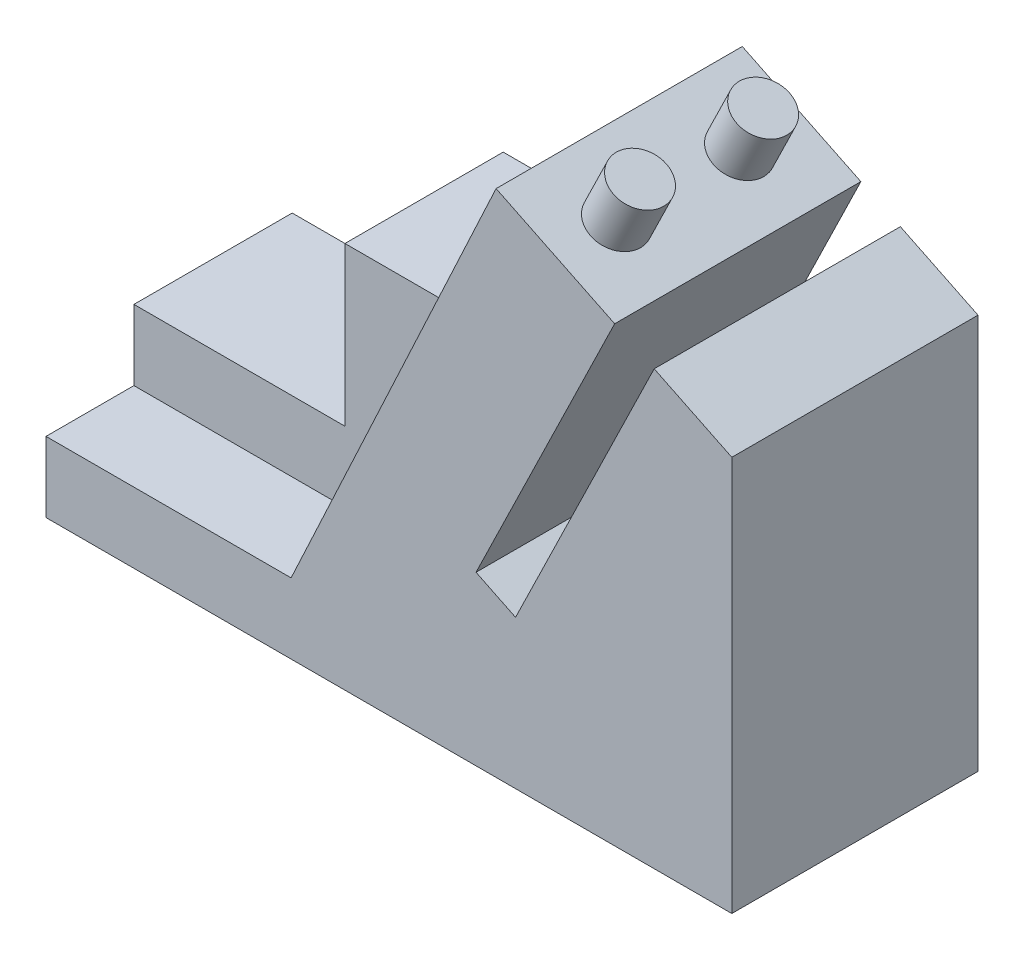
ISO-10303-21;
HEADER;
FILE_DESCRIPTION(('STEP AP214'),'2;1');
FILE_NAME('part.step','',(''),(''),'','','');
FILE_SCHEMA(('AUTOMOTIVE_DESIGN { 1 0 10303 214 1 1 1 1 }'));
ENDSEC;
DATA;
#1=APPLICATION_CONTEXT('core data for automotive mechanical design processes');
#2=APPLICATION_PROTOCOL_DEFINITION('international standard','automotive_design',2000,#1);
#3=PRODUCT_CONTEXT('',#1,'mechanical');
#4=PRODUCT('Part','Part','',(#3));
#5=PRODUCT_RELATED_PRODUCT_CATEGORY('part','',(#4));
#6=PRODUCT_DEFINITION_FORMATION('','',#4);
#7=PRODUCT_DEFINITION_CONTEXT('part definition',#1,'design');
#8=PRODUCT_DEFINITION('design','',#6,#7);
#9=PRODUCT_DEFINITION_SHAPE('','',#8);
#10=(LENGTH_UNIT() NAMED_UNIT(*) SI_UNIT(.MILLI.,.METRE.));
#11=(NAMED_UNIT(*) PLANE_ANGLE_UNIT() SI_UNIT($,.RADIAN.));
#12=(NAMED_UNIT(*) SI_UNIT($,.STERADIAN.) SOLID_ANGLE_UNIT());
#13=UNCERTAINTY_MEASURE_WITH_UNIT(LENGTH_MEASURE(1.E-05),#10,'distance_accuracy_value','');
#14=(GEOMETRIC_REPRESENTATION_CONTEXT(3) GLOBAL_UNCERTAINTY_ASSIGNED_CONTEXT((#13)) GLOBAL_UNIT_ASSIGNED_CONTEXT((#10,
#11,#12)) REPRESENTATION_CONTEXT('',''));
#15=CARTESIAN_POINT('',(0.,0.,0.));
#16=DIRECTION('',(0.,0.,1.));
#17=DIRECTION('',(1.,0.,0.));
#18=AXIS2_PLACEMENT_3D('',#15,#16,#17);
#19=CARTESIAN_POINT('',(0.,8.,28.));
#20=DIRECTION('',(0.,-1.,0.));
#21=DIRECTION('',(0.,0.,-1.));
#22=AXIS2_PLACEMENT_3D('',#19,#20,#21);
#23=PLANE('',#22);
#24=DIRECTION('',(-1.,0.,0.));
#25=VECTOR('',#24,1.);
#26=CARTESIAN_POINT('',(27.8760008879701,8.,18.));
#27=LINE('',#26,#25);
#28=CARTESIAN_POINT('',(27.8760008879701,8.,18.));
#29=VERTEX_POINT('',#28);
#30=CARTESIAN_POINT('',(0.,8.,18.));
#31=VERTEX_POINT('',#30);
#32=EDGE_CURVE('E174',#29,#31,#27,.T.);
#33=ORIENTED_EDGE('',*,*,#32,.T.);
#34=DIRECTION('',(0.,0.,-1.));
#35=VECTOR('',#34,1.);
#36=CARTESIAN_POINT('',(0.,8.,28.));
#37=LINE('',#36,#35);
#38=CARTESIAN_POINT('',(0.,8.,28.));
#39=VERTEX_POINT('',#38);
#40=EDGE_CURVE('E172',#39,#31,#37,.T.);
#41=ORIENTED_EDGE('',*,*,#40,.F.);
#42=DIRECTION('',(-1.,0.,0.));
#43=VECTOR('',#42,1.);
#44=CARTESIAN_POINT('',(0.,8.,28.));
#45=LINE('',#44,#43);
#46=CARTESIAN_POINT('',(27.8760008879701,8.,28.));
#47=VERTEX_POINT('',#46);
#48=EDGE_CURVE('E235',#47,#39,#45,.T.);
#49=ORIENTED_EDGE('',*,*,#48,.F.);
#50=DIRECTION('',(0.,0.,-1.));
#51=VECTOR('',#50,1.);
#52=CARTESIAN_POINT('',(27.8760008879701,8.,28.));
#53=LINE('',#52,#51);
#54=EDGE_CURVE('E265',#47,#29,#53,.T.);
#55=ORIENTED_EDGE('',*,*,#54,.T.);
#56=EDGE_LOOP('',(#33,#41,#49,#55));
#57=FACE_BOUND('',#56,.T.);
#58=ADVANCED_FACE('F43',(#57),#23,.F.);
#59=CARTESIAN_POINT('',(0.,0.,28.));
#60=DIRECTION('',(1.,0.,0.));
#61=DIRECTION('',(0.,0.,-1.));
#62=AXIS2_PLACEMENT_3D('',#59,#60,#61);
#63=PLANE('',#62);
#64=DIRECTION('',(0.,-1.,0.));
#65=VECTOR('',#64,1.);
#66=CARTESIAN_POINT('',(0.,0.,0.));
#67=LINE('',#66,#65);
#68=CARTESIAN_POINT('',(0.,16.,0.));
#69=VERTEX_POINT('',#68);
#70=CARTESIAN_POINT('',(0.,0.,0.));
#71=VERTEX_POINT('',#70);
#72=EDGE_CURVE('E200',#69,#71,#67,.T.);
#73=ORIENTED_EDGE('',*,*,#72,.T.);
#74=DIRECTION('',(0.,0.,-1.));
#75=VECTOR('',#74,1.);
#76=CARTESIAN_POINT('',(0.,0.,28.));
#77=LINE('',#76,#75);
#78=CARTESIAN_POINT('',(0.,0.,28.));
#79=VERTEX_POINT('',#78);
#80=EDGE_CURVE('E296',#79,#71,#77,.T.);
#81=ORIENTED_EDGE('',*,*,#80,.F.);
#82=DIRECTION('',(0.,-1.,0.));
#83=VECTOR('',#82,1.);
#84=CARTESIAN_POINT('',(0.,0.,28.));
#85=LINE('',#84,#83);
#86=EDGE_CURVE('E206',#39,#79,#85,.T.);
#87=ORIENTED_EDGE('',*,*,#86,.F.);
#88=ORIENTED_EDGE('',*,*,#40,.T.);
#89=DIRECTION('',(0.,1.,0.));
#90=VECTOR('',#89,1.);
#91=CARTESIAN_POINT('',(0.,8.,18.));
#92=LINE('',#91,#90);
#93=CARTESIAN_POINT('',(0.,16.,18.));
#94=VERTEX_POINT('',#93);
#95=EDGE_CURVE('E163',#31,#94,#92,.T.);
#96=ORIENTED_EDGE('',*,*,#95,.T.);
#97=DIRECTION('',(0.,0.,-1.));
#98=VECTOR('',#97,1.);
#99=CARTESIAN_POINT('',(0.,16.,18.));
#100=LINE('',#99,#98);
#101=EDGE_CURVE('E146',#94,#69,#100,.T.);
#102=ORIENTED_EDGE('',*,*,#101,.T.);
#103=EDGE_LOOP('',(#73,#81,#87,#88,#96,#102));
#104=FACE_BOUND('',#103,.T.);
#105=ADVANCED_FACE('F45',(#104),#63,.F.);
#106=CARTESIAN_POINT('',(0.,0.,28.));
#107=DIRECTION('',(0.,1.,0.));
#108=DIRECTION('',(0.,0.,1.));
#109=AXIS2_PLACEMENT_3D('',#106,#107,#108);
#110=PLANE('',#109);
#111=DIRECTION('',(1.,0.,0.));
#112=VECTOR('',#111,1.);
#113=CARTESIAN_POINT('',(0.,0.,0.));
#114=LINE('',#113,#112);
#115=CARTESIAN_POINT('',(78.,0.,0.));
#116=VERTEX_POINT('',#115);
#117=EDGE_CURVE('E240',#71,#116,#114,.T.);
#118=ORIENTED_EDGE('',*,*,#117,.T.);
#119=DIRECTION('',(0.,0.,-1.));
#120=VECTOR('',#119,1.);
#121=CARTESIAN_POINT('',(78.,0.,28.));
#122=LINE('',#121,#120);
#123=CARTESIAN_POINT('',(78.,0.,28.));
#124=VERTEX_POINT('',#123);
#125=EDGE_CURVE('E292',#124,#116,#122,.T.);
#126=ORIENTED_EDGE('',*,*,#125,.F.);
#127=DIRECTION('',(1.,0.,0.));
#128=VECTOR('',#127,1.);
#129=CARTESIAN_POINT('',(0.,0.,28.));
#130=LINE('',#129,#128);
#131=EDGE_CURVE('E210',#79,#124,#130,.T.);
#132=ORIENTED_EDGE('',*,*,#131,.F.);
#133=ORIENTED_EDGE('',*,*,#80,.T.);
#134=EDGE_LOOP('',(#118,#126,#132,#133));
#135=FACE_BOUND('',#134,.T.);
#136=ADVANCED_FACE('F354',(#135),#110,.F.);
#137=CARTESIAN_POINT('',(78.,0.,28.));
#138=DIRECTION('',(-1.,0.,0.));
#139=DIRECTION('',(0.,0.,1.));
#140=AXIS2_PLACEMENT_3D('',#137,#138,#139);
#141=PLANE('',#140);
#142=DIRECTION('',(0.,1.,0.));
#143=VECTOR('',#142,1.);
#144=CARTESIAN_POINT('',(78.,0.,0.));
#145=LINE('',#144,#143);
#146=CARTESIAN_POINT('',(78.,44.9393921056072,0.));
#147=VERTEX_POINT('',#146);
#148=EDGE_CURVE('E243',#116,#147,#145,.T.);
#149=ORIENTED_EDGE('',*,*,#148,.T.);
#150=DIRECTION('',(0.,0.,-1.));
#151=VECTOR('',#150,1.);
#152=CARTESIAN_POINT('',(78.,44.9393921056072,28.));
#153=LINE('',#152,#151);
#154=CARTESIAN_POINT('',(78.,44.9393921056072,28.));
#155=VERTEX_POINT('',#154);
#156=EDGE_CURVE('E288',#155,#147,#153,.T.);
#157=ORIENTED_EDGE('',*,*,#156,.F.);
#158=DIRECTION('',(0.,1.,0.));
#159=VECTOR('',#158,1.);
#160=CARTESIAN_POINT('',(78.,0.,28.));
#161=LINE('',#160,#159);
#162=EDGE_CURVE('E214',#124,#155,#161,.T.);
#163=ORIENTED_EDGE('',*,*,#162,.F.);
#164=ORIENTED_EDGE('',*,*,#125,.T.);
#165=EDGE_LOOP('',(#149,#157,#163,#164));
#166=FACE_BOUND('',#165,.T.);
#167=ADVANCED_FACE('F350',(#166),#141,.F.);
#168=CARTESIAN_POINT('',(69.1711811724653,49.2406115344061,28.));
#169=DIRECTION('',(-0.437969423279694,-0.89898986883727,0.));
#170=DIRECTION('',(0.89898986883727,-0.437969423279694,0.));
#171=AXIS2_PLACEMENT_3D('',#168,#169,#170);
#172=PLANE('',#171);
#173=DIRECTION('',(-0.89898986883727,0.437969423279694,0.));
#174=VECTOR('',#173,1.);
#175=CARTESIAN_POINT('',(69.1711811724653,49.2406115344061,0.));
#176=LINE('',#175,#174);
#177=CARTESIAN_POINT('',(69.1711811724653,49.2406115344061,0.));
#178=VERTEX_POINT('',#177);
#179=EDGE_CURVE('E246',#147,#178,#176,.T.);
#180=ORIENTED_EDGE('',*,*,#179,.T.);
#181=DIRECTION('',(0.,0.,-1.));
#182=VECTOR('',#181,1.);
#183=CARTESIAN_POINT('',(69.1711811724653,49.2406115344061,28.));
#184=LINE('',#183,#182);
#185=CARTESIAN_POINT('',(69.1711811724653,49.2406115344061,28.));
#186=VERTEX_POINT('',#185);
#187=EDGE_CURVE('E284',#186,#178,#184,.T.);
#188=ORIENTED_EDGE('',*,*,#187,.F.);
#189=DIRECTION('',(-0.89898986883727,0.437969423279694,0.));
#190=VECTOR('',#189,1.);
#191=CARTESIAN_POINT('',(69.1711811724653,49.2406115344061,28.));
#192=LINE('',#191,#190);
#193=EDGE_CURVE('E217',#155,#186,#192,.T.);
#194=ORIENTED_EDGE('',*,*,#193,.F.);
#195=ORIENTED_EDGE('',*,*,#156,.T.);
#196=EDGE_LOOP('',(#180,#188,#194,#195));
#197=FACE_BOUND('',#196,.T.);
#198=ADVANCED_FACE('F346',(#197),#172,.F.);
#199=CARTESIAN_POINT('',(53.4042819343963,16.8769762562644,28.));
#200=DIRECTION('',(0.89898986883727,-0.437969423279694,0.));
#201=DIRECTION('',(0.437969423279694,0.89898986883727,0.));
#202=AXIS2_PLACEMENT_3D('',#199,#200,#201);
#203=PLANE('',#202);
#204=DIRECTION('',(-0.437969423279694,-0.89898986883727,0.));
#205=VECTOR('',#204,1.);
#206=CARTESIAN_POINT('',(53.4042819343963,16.8769762562644,0.));
#207=LINE('',#206,#205);
#208=CARTESIAN_POINT('',(53.4042819343963,16.8769762562644,0.));
#209=VERTEX_POINT('',#208);
#210=EDGE_CURVE('E249',#178,#209,#207,.T.);
#211=ORIENTED_EDGE('',*,*,#210,.T.);
#212=DIRECTION('',(0.,0.,-1.));
#213=VECTOR('',#212,1.);
#214=CARTESIAN_POINT('',(53.4042819343963,16.8769762562644,28.));
#215=LINE('',#214,#213);
#216=CARTESIAN_POINT('',(53.4042819343963,16.8769762562644,28.));
#217=VERTEX_POINT('',#216);
#218=EDGE_CURVE('E280',#217,#209,#215,.T.);
#219=ORIENTED_EDGE('',*,*,#218,.F.);
#220=DIRECTION('',(-0.437969423279694,-0.89898986883727,0.));
#221=VECTOR('',#220,1.);
#222=CARTESIAN_POINT('',(53.4042819343963,16.8769762562644,28.));
#223=LINE('',#222,#221);
#224=EDGE_CURVE('E220',#186,#217,#223,.T.);
#225=ORIENTED_EDGE('',*,*,#224,.F.);
#226=ORIENTED_EDGE('',*,*,#187,.T.);
#227=EDGE_LOOP('',(#211,#219,#225,#226));
#228=FACE_BOUND('',#227,.T.);
#229=ADVANCED_FACE('F342',(#228),#203,.F.);
#230=CARTESIAN_POINT('',(48.9093325902099,19.0668233726629,28.));
#231=DIRECTION('',(-0.437969423279694,-0.89898986883727,0.));
#232=DIRECTION('',(0.89898986883727,-0.437969423279694,0.));
#233=AXIS2_PLACEMENT_3D('',#230,#231,#232);
#234=PLANE('',#233);
#235=DIRECTION('',(-0.89898986883727,0.437969423279694,0.));
#236=VECTOR('',#235,1.);
#237=CARTESIAN_POINT('',(48.9093325902099,19.0668233726629,0.));
#238=LINE('',#237,#236);
#239=CARTESIAN_POINT('',(48.9093325902099,19.0668233726629,0.));
#240=VERTEX_POINT('',#239);
#241=EDGE_CURVE('E252',#209,#240,#238,.T.);
#242=ORIENTED_EDGE('',*,*,#241,.T.);
#243=DIRECTION('',(0.,0.,-1.));
#244=VECTOR('',#243,1.);
#245=CARTESIAN_POINT('',(48.9093325902099,19.0668233726629,28.));
#246=LINE('',#245,#244);
#247=CARTESIAN_POINT('',(48.9093325902099,19.0668233726629,28.));
#248=VERTEX_POINT('',#247);
#249=EDGE_CURVE('E276',#248,#240,#246,.T.);
#250=ORIENTED_EDGE('',*,*,#249,.F.);
#251=DIRECTION('',(-0.89898986883727,0.437969423279694,0.));
#252=VECTOR('',#251,1.);
#253=CARTESIAN_POINT('',(48.9093325902099,19.0668233726629,28.));
#254=LINE('',#253,#252);
#255=EDGE_CURVE('E223',#217,#248,#254,.T.);
#256=ORIENTED_EDGE('',*,*,#255,.F.);
#257=ORIENTED_EDGE('',*,*,#218,.T.);
#258=EDGE_LOOP('',(#242,#250,#256,#257));
#259=FACE_BOUND('',#258,.T.);
#260=ADVANCED_FACE('F338',(#259),#234,.F.);
#261=CARTESIAN_POINT('',(64.6762318282789,51.4304586508046,28.));
#262=DIRECTION('',(-0.89898986883727,0.437969423279694,0.));
#263=DIRECTION('',(-0.437969423279694,-0.89898986883727,0.));
#264=AXIS2_PLACEMENT_3D('',#261,#262,#263);
#265=PLANE('',#264);
#266=DIRECTION('',(0.437969423279694,0.89898986883727,0.));
#267=VECTOR('',#266,1.);
#268=CARTESIAN_POINT('',(64.6762318282789,51.4304586508046,0.));
#269=LINE('',#268,#267);
#270=CARTESIAN_POINT('',(64.6762318282789,51.4304586508046,0.));
#271=VERTEX_POINT('',#270);
#272=EDGE_CURVE('E255',#240,#271,#269,.T.);
#273=ORIENTED_EDGE('',*,*,#272,.T.);
#274=DIRECTION('',(0.,0.,-1.));
#275=VECTOR('',#274,1.);
#276=CARTESIAN_POINT('',(64.6762318282789,51.4304586508046,28.));
#277=LINE('',#276,#275);
#278=CARTESIAN_POINT('',(64.6762318282789,51.4304586508046,28.));
#279=VERTEX_POINT('',#278);
#280=EDGE_CURVE('E272',#279,#271,#277,.T.);
#281=ORIENTED_EDGE('',*,*,#280,.F.);
#282=DIRECTION('',(0.437969423279694,0.89898986883727,0.));
#283=VECTOR('',#282,1.);
#284=CARTESIAN_POINT('',(64.6762318282789,51.4304586508046,28.));
#285=LINE('',#284,#283);
#286=EDGE_CURVE('E226',#248,#279,#285,.T.);
#287=ORIENTED_EDGE('',*,*,#286,.F.);
#288=ORIENTED_EDGE('',*,*,#249,.T.);
#289=EDGE_LOOP('',(#273,#281,#287,#288));
#290=FACE_BOUND('',#289,.T.);
#291=ADVANCED_FACE('F309',(#290),#265,.F.);
#292=CARTESIAN_POINT('',(51.1913837957199,58.,28.));
#293=DIRECTION('',(-0.437969423279694,-0.89898986883727,0.));
#294=DIRECTION('',(0.89898986883727,-0.437969423279694,0.));
#295=AXIS2_PLACEMENT_3D('',#292,#293,#294);
#296=PLANE('',#295);
#297=CARTESIAN_POINT('',(57.9338078119994,54.7152293254023,7.));
#298=DIRECTION('',(-0.437969423279694,-0.89898986883727,0.));
#299=DIRECTION('',(0.89898986883727,-0.437969423279694,0.));
#300=AXIS2_PLACEMENT_3D('',#297,#298,#299);
#301=CIRCLE('',#300,3.);
#302=CARTESIAN_POINT('',(60.6307774185112,53.4013210555632,7.));
#303=VERTEX_POINT('',#302);
#304=EDGE_CURVE('E11',#303,#303,#301,.F.);
#305=ORIENTED_EDGE('',*,*,#304,.F.);
#306=EDGE_LOOP('',(#305));
#307=FACE_BOUND('',#306,.T.);
#308=CARTESIAN_POINT('',(57.9338078119994,54.7152293254023,21.));
#309=DIRECTION('',(-0.437969423279694,-0.89898986883727,0.));
#310=DIRECTION('',(0.89898986883727,-0.437969423279694,0.));
#311=AXIS2_PLACEMENT_3D('',#308,#309,#310);
#312=CIRCLE('',#311,3.);
#313=CARTESIAN_POINT('',(60.6307774185112,53.4013210555632,21.));
#314=VERTEX_POINT('',#313);
#315=EDGE_CURVE('E52',#314,#314,#312,.F.);
#316=ORIENTED_EDGE('',*,*,#315,.F.);
#317=EDGE_LOOP('',(#316));
#318=FACE_BOUND('',#317,.T.);
#319=DIRECTION('',(-0.89898986883727,0.437969423279694,0.));
#320=VECTOR('',#319,1.);
#321=CARTESIAN_POINT('',(51.1913837957199,58.,0.));
#322=LINE('',#321,#320);
#323=CARTESIAN_POINT('',(51.1913837957199,58.,0.));
#324=VERTEX_POINT('',#323);
#325=EDGE_CURVE('E258',#271,#324,#322,.T.);
#326=ORIENTED_EDGE('',*,*,#325,.T.);
#327=DIRECTION('',(0.,0.,-1.));
#328=VECTOR('',#327,1.);
#329=CARTESIAN_POINT('',(51.1913837957199,58.,28.));
#330=LINE('',#329,#328);
#331=CARTESIAN_POINT('',(51.1913837957199,58.,28.));
#332=VERTEX_POINT('',#331);
#333=EDGE_CURVE('E268',#332,#324,#330,.T.);
#334=ORIENTED_EDGE('',*,*,#333,.F.);
#335=DIRECTION('',(-0.89898986883727,0.437969423279694,0.));
#336=VECTOR('',#335,1.);
#337=CARTESIAN_POINT('',(51.1913837957199,58.,28.));
#338=LINE('',#337,#336);
#339=EDGE_CURVE('E229',#279,#332,#338,.T.);
#340=ORIENTED_EDGE('',*,*,#339,.F.);
#341=ORIENTED_EDGE('',*,*,#280,.T.);
#342=EDGE_LOOP('',(#326,#334,#340,#341));
#343=FACE_BOUND('',#342,.T.);
#344=ADVANCED_FACE('F305',(#307,#318,#343),#296,.F.);
#345=CARTESIAN_POINT('',(27.8760008879701,8.,28.));
#346=DIRECTION('',(0.906307787036651,-0.422618261740697,0.));
#347=DIRECTION('',(0.422618261740697,0.906307787036651,0.));
#348=AXIS2_PLACEMENT_3D('',#345,#346,#347);
#349=PLANE('',#348);
#350=DIRECTION('',(-0.422618261740697,-0.906307787036651,0.));
#351=VECTOR('',#350,1.);
#352=CARTESIAN_POINT('',(27.8760008879701,8.,0.));
#353=LINE('',#352,#351);
#354=CARTESIAN_POINT('',(40.,34.,0.));
#355=VERTEX_POINT('',#354);
#356=EDGE_CURVE('E211',#324,#355,#353,.T.);
#357=ORIENTED_EDGE('',*,*,#356,.T.);
#358=DIRECTION('',(0.,0.,-1.));
#359=VECTOR('',#358,1.);
#360=CARTESIAN_POINT('',(40.,34.,18.));
#361=LINE('',#360,#359);
#362=CARTESIAN_POINT('',(40.,34.,18.));
#363=VERTEX_POINT('',#362);
#364=EDGE_CURVE('E59',#363,#355,#361,.T.);
#365=ORIENTED_EDGE('',*,*,#364,.F.);
#366=DIRECTION('',(-0.422618261740697,-0.906307787036651,0.));
#367=VECTOR('',#366,1.);
#368=CARTESIAN_POINT('',(40.,34.,18.));
#369=LINE('',#368,#367);
#370=EDGE_CURVE('E64',#363,#29,#369,.T.);
#371=ORIENTED_EDGE('',*,*,#370,.T.);
#372=ORIENTED_EDGE('',*,*,#54,.F.);
#373=DIRECTION('',(-0.422618261740697,-0.906307787036651,0.));
#374=VECTOR('',#373,1.);
#375=CARTESIAN_POINT('',(27.8760008879701,8.,28.));
#376=LINE('',#375,#374);
#377=EDGE_CURVE('E232',#332,#47,#376,.T.);
#378=ORIENTED_EDGE('',*,*,#377,.F.);
#379=ORIENTED_EDGE('',*,*,#333,.T.);
#380=EDGE_LOOP('',(#357,#365,#371,#372,#378,#379));
#381=FACE_BOUND('',#380,.T.);
#382=ADVANCED_FACE('F308',(#381),#349,.F.);
#383=CARTESIAN_POINT('',(0.,0.,28.));
#384=DIRECTION('',(0.,0.,-1.));
#385=DIRECTION('',(-1.,0.,0.));
#386=AXIS2_PLACEMENT_3D('',#383,#384,#385);
#387=PLANE('',#386);
#388=ORIENTED_EDGE('',*,*,#86,.T.);
#389=ORIENTED_EDGE('',*,*,#131,.T.);
#390=ORIENTED_EDGE('',*,*,#162,.T.);
#391=ORIENTED_EDGE('',*,*,#193,.T.);
#392=ORIENTED_EDGE('',*,*,#224,.T.);
#393=ORIENTED_EDGE('',*,*,#255,.T.);
#394=ORIENTED_EDGE('',*,*,#286,.T.);
#395=ORIENTED_EDGE('',*,*,#339,.T.);
#396=ORIENTED_EDGE('',*,*,#377,.T.);
#397=ORIENTED_EDGE('',*,*,#48,.T.);
#398=EDGE_LOOP('',(#388,#389,#390,#391,#392,#393,#394,#395,#396,#397));
#399=FACE_BOUND('',#398,.T.);
#400=ADVANCED_FACE('F328',(#399),#387,.F.);
#401=CARTESIAN_POINT('',(0.,0.,0.));
#402=DIRECTION('',(0.,0.,-1.));
#403=DIRECTION('',(-1.,0.,0.));
#404=AXIS2_PLACEMENT_3D('',#401,#402,#403);
#405=PLANE('',#404);
#406=ORIENTED_EDGE('',*,*,#72,.F.);
#407=DIRECTION('',(1.,0.,0.));
#408=VECTOR('',#407,1.);
#409=CARTESIAN_POINT('',(0.,16.,0.));
#410=LINE('',#409,#408);
#411=CARTESIAN_POINT('',(24.,16.,0.));
#412=VERTEX_POINT('',#411);
#413=EDGE_CURVE('E151',#69,#412,#410,.T.);
#414=ORIENTED_EDGE('',*,*,#413,.T.);
#415=DIRECTION('',(0.,1.,0.));
#416=VECTOR('',#415,1.);
#417=CARTESIAN_POINT('',(24.,16.,0.));
#418=LINE('',#417,#416);
#419=CARTESIAN_POINT('',(24.,34.,0.));
#420=VERTEX_POINT('',#419);
#421=EDGE_CURVE('E190',#412,#420,#418,.T.);
#422=ORIENTED_EDGE('',*,*,#421,.T.);
#423=DIRECTION('',(1.,0.,0.));
#424=VECTOR('',#423,1.);
#425=CARTESIAN_POINT('',(24.,34.,0.));
#426=LINE('',#425,#424);
#427=EDGE_CURVE('E177',#420,#355,#426,.T.);
#428=ORIENTED_EDGE('',*,*,#427,.T.);
#429=ORIENTED_EDGE('',*,*,#356,.F.);
#430=ORIENTED_EDGE('',*,*,#325,.F.);
#431=ORIENTED_EDGE('',*,*,#272,.F.);
#432=ORIENTED_EDGE('',*,*,#241,.F.);
#433=ORIENTED_EDGE('',*,*,#210,.F.);
#434=ORIENTED_EDGE('',*,*,#179,.F.);
#435=ORIENTED_EDGE('',*,*,#148,.F.);
#436=ORIENTED_EDGE('',*,*,#117,.F.);
#437=EDGE_LOOP('',(#406,#414,#422,#428,#429,#430,#431,#432,#433,#434,#435,#436));
#438=FACE_BOUND('',#437,.T.);
#439=ADVANCED_FACE('F320',(#438),#405,.T.);
#440=CARTESIAN_POINT('',(24.,34.,18.));
#441=DIRECTION('',(0.,1.,0.));
#442=DIRECTION('',(-1.,0.,0.));
#443=AXIS2_PLACEMENT_3D('',#440,#441,#442);
#444=PLANE('',#443);
#445=ORIENTED_EDGE('',*,*,#427,.F.);
#446=DIRECTION('',(0.,0.,-1.));
#447=VECTOR('',#446,1.);
#448=CARTESIAN_POINT('',(24.,34.,18.));
#449=LINE('',#448,#447);
#450=CARTESIAN_POINT('',(24.,34.,18.));
#451=VERTEX_POINT('',#450);
#452=EDGE_CURVE('E201',#451,#420,#449,.T.);
#453=ORIENTED_EDGE('',*,*,#452,.F.);
#454=DIRECTION('',(1.,0.,0.));
#455=VECTOR('',#454,1.);
#456=CARTESIAN_POINT('',(24.,34.,18.));
#457=LINE('',#456,#455);
#458=EDGE_CURVE('E183',#451,#363,#457,.T.);
#459=ORIENTED_EDGE('',*,*,#458,.T.);
#460=ORIENTED_EDGE('',*,*,#364,.T.);
#461=EDGE_LOOP('',(#445,#453,#459,#460));
#462=FACE_BOUND('',#461,.T.);
#463=ADVANCED_FACE('F324',(#462),#444,.T.);
#464=CARTESIAN_POINT('',(24.,16.,18.));
#465=DIRECTION('',(-1.,0.,0.));
#466=DIRECTION('',(0.,0.,1.));
#467=AXIS2_PLACEMENT_3D('',#464,#465,#466);
#468=PLANE('',#467);
#469=ORIENTED_EDGE('',*,*,#421,.F.);
#470=DIRECTION('',(0.,0.,-1.));
#471=VECTOR('',#470,1.);
#472=CARTESIAN_POINT('',(24.,16.,18.));
#473=LINE('',#472,#471);
#474=CARTESIAN_POINT('',(24.,16.,18.));
#475=VERTEX_POINT('',#474);
#476=EDGE_CURVE('E156',#475,#412,#473,.T.);
#477=ORIENTED_EDGE('',*,*,#476,.F.);
#478=DIRECTION('',(0.,1.,0.));
#479=VECTOR('',#478,1.);
#480=CARTESIAN_POINT('',(24.,16.,18.));
#481=LINE('',#480,#479);
#482=EDGE_CURVE('E166',#475,#451,#481,.T.);
#483=ORIENTED_EDGE('',*,*,#482,.T.);
#484=ORIENTED_EDGE('',*,*,#452,.T.);
#485=EDGE_LOOP('',(#469,#477,#483,#484));
#486=FACE_BOUND('',#485,.T.);
#487=ADVANCED_FACE('F420',(#486),#468,.T.);
#488=CARTESIAN_POINT('',(0.,16.,18.));
#489=DIRECTION('',(0.,1.,0.));
#490=DIRECTION('',(-1.,0.,0.));
#491=AXIS2_PLACEMENT_3D('',#488,#489,#490);
#492=PLANE('',#491);
#493=ORIENTED_EDGE('',*,*,#413,.F.);
#494=ORIENTED_EDGE('',*,*,#101,.F.);
#495=DIRECTION('',(1.,0.,0.));
#496=VECTOR('',#495,1.);
#497=CARTESIAN_POINT('',(0.,16.,18.));
#498=LINE('',#497,#496);
#499=EDGE_CURVE('E149',#94,#475,#498,.T.);
#500=ORIENTED_EDGE('',*,*,#499,.T.);
#501=ORIENTED_EDGE('',*,*,#476,.T.);
#502=EDGE_LOOP('',(#493,#494,#500,#501));
#503=FACE_BOUND('',#502,.T.);
#504=ADVANCED_FACE('F148',(#503),#492,.T.);
#505=CARTESIAN_POINT('',(0.,0.,18.));
#506=DIRECTION('',(0.,0.,-1.));
#507=DIRECTION('',(-1.,0.,0.));
#508=AXIS2_PLACEMENT_3D('',#505,#506,#507);
#509=PLANE('',#508);
#510=ORIENTED_EDGE('',*,*,#32,.F.);
#511=ORIENTED_EDGE('',*,*,#370,.F.);
#512=ORIENTED_EDGE('',*,*,#458,.F.);
#513=ORIENTED_EDGE('',*,*,#482,.F.);
#514=ORIENTED_EDGE('',*,*,#499,.F.);
#515=ORIENTED_EDGE('',*,*,#95,.F.);
#516=EDGE_LOOP('',(#510,#511,#512,#513,#514,#515));
#517=FACE_BOUND('',#516,.T.);
#518=ADVANCED_FACE('F162',(#517),#509,.F.);
#519=CARTESIAN_POINT('',(60.5616243516776,60.1091685384259,21.));
#520=DIRECTION('',(-0.437969423279694,-0.89898986883727,0.));
#521=DIRECTION('',(0.89898986883727,-0.437969423279694,0.));
#522=AXIS2_PLACEMENT_3D('',#519,#520,#521);
#523=CYLINDRICAL_SURFACE('',#522,3.);
#524=CARTESIAN_POINT('',(60.5616243516776,60.1091685384259,21.));
#525=DIRECTION('',(0.437969423279694,0.89898986883727,0.));
#526=DIRECTION('',(-0.89898986883727,0.437969423279694,0.));
#527=AXIS2_PLACEMENT_3D('',#524,#525,#526);
#528=CIRCLE('',#527,3.);
#529=CARTESIAN_POINT('',(57.8646547451658,61.423076808265,21.));
#530=VERTEX_POINT('',#529);
#531=EDGE_CURVE('E191',#530,#530,#528,.T.);
#532=ORIENTED_EDGE('',*,*,#531,.F.);
#533=EDGE_LOOP('',(#532));
#534=FACE_BOUND('',#533,.T.);
#535=ORIENTED_EDGE('',*,*,#315,.T.);
#536=EDGE_LOOP('',(#535));
#537=FACE_BOUND('',#536,.T.);
#538=ADVANCED_FACE('F303',(#534,#537),#523,.T.);
#539=CARTESIAN_POINT('',(60.5616243516776,60.1091685384259,21.));
#540=DIRECTION('',(0.437969423279694,0.89898986883727,0.));
#541=DIRECTION('',(-0.89898986883727,0.437969423279694,0.));
#542=AXIS2_PLACEMENT_3D('',#539,#540,#541);
#543=PLANE('',#542);
#544=ORIENTED_EDGE('',*,*,#531,.T.);
#545=EDGE_LOOP('',(#544));
#546=FACE_BOUND('',#545,.T.);
#547=ADVANCED_FACE('F444',(#546),#543,.T.);
#548=CARTESIAN_POINT('',(60.5616243516776,60.1091685384259,7.));
#549=DIRECTION('',(-0.437969423279694,-0.89898986883727,0.));
#550=DIRECTION('',(0.89898986883727,-0.437969423279694,0.));
#551=AXIS2_PLACEMENT_3D('',#548,#549,#550);
#552=CYLINDRICAL_SURFACE('',#551,3.);
#553=CARTESIAN_POINT('',(60.5616243516776,60.1091685384259,7.));
#554=DIRECTION('',(0.437969423279694,0.89898986883727,0.));
#555=DIRECTION('',(-0.89898986883727,0.437969423279694,0.));
#556=AXIS2_PLACEMENT_3D('',#553,#554,#555);
#557=CIRCLE('',#556,3.);
#558=CARTESIAN_POINT('',(57.8646547451658,61.423076808265,7.));
#559=VERTEX_POINT('',#558);
#560=EDGE_CURVE('E568',#559,#559,#557,.T.);
#561=ORIENTED_EDGE('',*,*,#560,.F.);
#562=EDGE_LOOP('',(#561));
#563=FACE_BOUND('',#562,.T.);
#564=ORIENTED_EDGE('',*,*,#304,.T.);
#565=EDGE_LOOP('',(#564));
#566=FACE_BOUND('',#565,.T.);
#567=ADVANCED_FACE('F452',(#563,#566),#552,.T.);
#568=CARTESIAN_POINT('',(60.5616243516776,60.1091685384259,7.));
#569=DIRECTION('',(0.437969423279694,0.89898986883727,0.));
#570=DIRECTION('',(-0.89898986883727,0.437969423279694,0.));
#571=AXIS2_PLACEMENT_3D('',#568,#569,#570);
#572=PLANE('',#571);
#573=ORIENTED_EDGE('',*,*,#560,.T.);
#574=EDGE_LOOP('',(#573));
#575=FACE_BOUND('',#574,.T.);
#576=ADVANCED_FACE('F460',(#575),#572,.T.);
#577=CLOSED_SHELL('',(#58,#105,#136,#167,#198,#229,#260,#291,#344,#382,#400,#439,#463,#487,#504,
#518,#538,#547,#567,#576));
#578=MANIFOLD_SOLID_BREP('B2',#577);
#579=ADVANCED_BREP_SHAPE_REPRESENTATION('',(#18,#578),#14);
#580=SHAPE_DEFINITION_REPRESENTATION(#9,#579);
ENDSEC;
END-ISO-10303-21;
